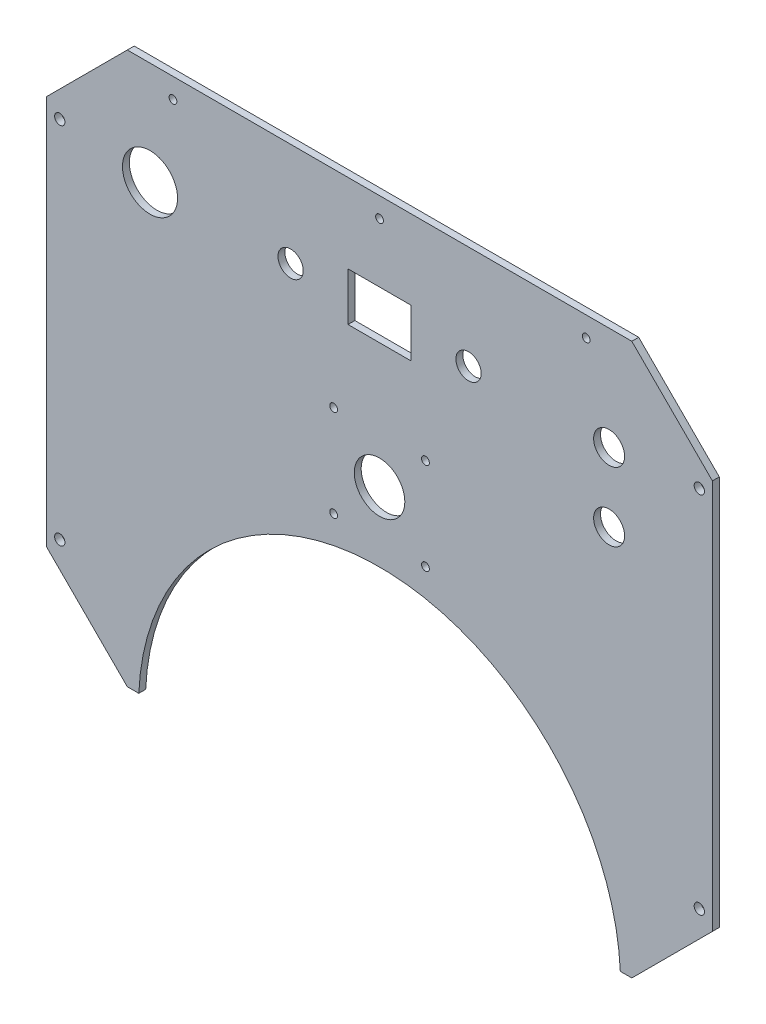
ISO-10303-21;
HEADER;
FILE_DESCRIPTION(('STEP AP214'),'2;1');
FILE_NAME('part.step','',(''),(''),'','','');
FILE_SCHEMA(('AUTOMOTIVE_DESIGN { 1 0 10303 214 1 1 1 1 }'));
ENDSEC;
DATA;
#1=APPLICATION_CONTEXT('core data for automotive mechanical design processes');
#2=APPLICATION_PROTOCOL_DEFINITION('international standard','automotive_design',2000,#1);
#3=PRODUCT_CONTEXT('',#1,'mechanical');
#4=PRODUCT('Part','Part','',(#3));
#5=PRODUCT_RELATED_PRODUCT_CATEGORY('part','',(#4));
#6=PRODUCT_DEFINITION_FORMATION('','',#4);
#7=PRODUCT_DEFINITION_CONTEXT('part definition',#1,'design');
#8=PRODUCT_DEFINITION('design','',#6,#7);
#9=PRODUCT_DEFINITION_SHAPE('','',#8);
#10=(LENGTH_UNIT() NAMED_UNIT(*) SI_UNIT(.MILLI.,.METRE.));
#11=(NAMED_UNIT(*) PLANE_ANGLE_UNIT() SI_UNIT($,.RADIAN.));
#12=(NAMED_UNIT(*) SI_UNIT($,.STERADIAN.) SOLID_ANGLE_UNIT());
#13=UNCERTAINTY_MEASURE_WITH_UNIT(LENGTH_MEASURE(1.E-05),#10,'distance_accuracy_value','');
#14=(GEOMETRIC_REPRESENTATION_CONTEXT(3) GLOBAL_UNCERTAINTY_ASSIGNED_CONTEXT((#13)) GLOBAL_UNIT_ASSIGNED_CONTEXT((#10,
#11,#12)) REPRESENTATION_CONTEXT('',''));
#15=CARTESIAN_POINT('',(0.,0.,0.));
#16=DIRECTION('',(0.,0.,1.));
#17=DIRECTION('',(1.,0.,0.));
#18=AXIS2_PLACEMENT_3D('',#15,#16,#17);
#19=CARTESIAN_POINT('',(-145.000000000024,84.9999999999824,3.));
#20=DIRECTION('',(1.,0.,0.));
#21=DIRECTION('',(0.,0.,-1.));
#22=AXIS2_PLACEMENT_3D('',#19,#20,#21);
#23=PLANE('',#22);
#24=DIRECTION('',(0.,-1.,0.));
#25=VECTOR('',#24,1.);
#26=CARTESIAN_POINT('',(-145.000000000024,84.9999999999824,0.));
#27=LINE('',#26,#25);
#28=CARTESIAN_POINT('',(-145.000000000024,84.9999999999824,0.));
#29=VERTEX_POINT('',#28);
#30=CARTESIAN_POINT('',(-145.000000000024,-85.0000000000195,0.));
#31=VERTEX_POINT('',#30);
#32=EDGE_CURVE('E217',#29,#31,#27,.T.);
#33=ORIENTED_EDGE('',*,*,#32,.T.);
#34=DIRECTION('',(0.,0.,-1.));
#35=VECTOR('',#34,1.);
#36=CARTESIAN_POINT('',(-145.000000000024,-85.0000000000195,3.));
#37=LINE('',#36,#35);
#38=CARTESIAN_POINT('',(-145.000000000024,-85.0000000000195,3.));
#39=VERTEX_POINT('',#38);
#40=EDGE_CURVE('E263',#39,#31,#37,.T.);
#41=ORIENTED_EDGE('',*,*,#40,.F.);
#42=DIRECTION('',(0.,-1.,0.));
#43=VECTOR('',#42,1.);
#44=CARTESIAN_POINT('',(-145.000000000024,84.9999999999824,3.));
#45=LINE('',#44,#43);
#46=CARTESIAN_POINT('',(-145.000000000024,84.9999999999824,3.));
#47=VERTEX_POINT('',#46);
#48=EDGE_CURVE('E194',#47,#39,#45,.T.);
#49=ORIENTED_EDGE('',*,*,#48,.F.);
#50=DIRECTION('',(0.,0.,-1.));
#51=VECTOR('',#50,1.);
#52=CARTESIAN_POINT('',(-145.000000000024,84.9999999999824,3.));
#53=LINE('',#52,#51);
#54=EDGE_CURVE('E216',#47,#29,#53,.T.);
#55=ORIENTED_EDGE('',*,*,#54,.T.);
#56=EDGE_LOOP('',(#33,#41,#49,#55));
#57=FACE_BOUND('',#56,.T.);
#58=ADVANCED_FACE('F31',(#57),#23,.F.);
#59=CARTESIAN_POINT('',(-145.000000000024,-85.0000000000195,3.));
#60=DIRECTION('',(0.707106781186488,0.707106781186606,0.));
#61=DIRECTION('',(-0.707106781186607,0.707106781186488,0.));
#62=AXIS2_PLACEMENT_3D('',#59,#60,#61);
#63=PLANE('',#62);
#64=DIRECTION('',(0.707106781186607,-0.707106781186489,0.));
#65=VECTOR('',#64,1.);
#66=CARTESIAN_POINT('',(-145.000000000024,-85.0000000000195,0.));
#67=LINE('',#66,#65);
#68=CARTESIAN_POINT('',(-109.886246000254,-120.113753999785,0.));
#69=VERTEX_POINT('',#68);
#70=EDGE_CURVE('E220',#31,#69,#67,.T.);
#71=ORIENTED_EDGE('',*,*,#70,.T.);
#72=DIRECTION('',(0.,0.,-1.));
#73=VECTOR('',#72,1.);
#74=CARTESIAN_POINT('',(-109.886246000254,-120.113753999785,3.));
#75=LINE('',#74,#73);
#76=CARTESIAN_POINT('',(-109.886246000254,-120.113753999785,3.));
#77=VERTEX_POINT('',#76);
#78=EDGE_CURVE('E260',#77,#69,#75,.T.);
#79=ORIENTED_EDGE('',*,*,#78,.F.);
#80=DIRECTION('',(0.707106781186607,-0.707106781186489,0.));
#81=VECTOR('',#80,1.);
#82=CARTESIAN_POINT('',(-145.000000000024,-85.0000000000195,3.));
#83=LINE('',#82,#81);
#84=EDGE_CURVE('E197',#39,#77,#83,.T.);
#85=ORIENTED_EDGE('',*,*,#84,.F.);
#86=ORIENTED_EDGE('',*,*,#40,.T.);
#87=EDGE_LOOP('',(#71,#79,#85,#86));
#88=FACE_BOUND('',#87,.T.);
#89=ADVANCED_FACE('F308',(#88),#63,.F.);
#90=CARTESIAN_POINT('',(-109.886246000254,-120.113753999785,3.));
#91=DIRECTION('',(0.,1.,0.));
#92=DIRECTION('',(0.,0.,1.));
#93=AXIS2_PLACEMENT_3D('',#90,#91,#92);
#94=PLANE('',#93);
#95=DIRECTION('',(1.,0.,0.));
#96=VECTOR('',#95,1.);
#97=CARTESIAN_POINT('',(-109.886246000254,-120.113753999785,0.));
#98=LINE('',#97,#96);
#99=CARTESIAN_POINT('',(-104.886246000252,-120.113753999785,0.));
#100=VERTEX_POINT('',#99);
#101=EDGE_CURVE('E222',#69,#100,#98,.T.);
#102=ORIENTED_EDGE('',*,*,#101,.T.);
#103=DIRECTION('',(0.,0.,-1.));
#104=VECTOR('',#103,1.);
#105=CARTESIAN_POINT('',(-104.886246000252,-120.113753999785,3.));
#106=LINE('',#105,#104);
#107=CARTESIAN_POINT('',(-104.886246000252,-120.113753999785,3.));
#108=VERTEX_POINT('',#107);
#109=EDGE_CURVE('E257',#108,#100,#106,.T.);
#110=ORIENTED_EDGE('',*,*,#109,.F.);
#111=DIRECTION('',(1.,0.,0.));
#112=VECTOR('',#111,1.);
#113=CARTESIAN_POINT('',(-109.886246000254,-120.113753999785,3.));
#114=LINE('',#113,#112);
#115=EDGE_CURVE('E200',#77,#108,#114,.T.);
#116=ORIENTED_EDGE('',*,*,#115,.F.);
#117=ORIENTED_EDGE('',*,*,#78,.T.);
#118=EDGE_LOOP('',(#102,#110,#116,#117));
#119=FACE_BOUND('',#118,.T.);
#120=ADVANCED_FACE('F313',(#119),#94,.F.);
#121=CARTESIAN_POINT('',(1.79238312827414E-13,-125.000000000053,3.));
#122=DIRECTION('',(0.,0.,-1.));
#123=DIRECTION('',(-1.,0.,0.));
#124=AXIS2_PLACEMENT_3D('',#121,#122,#123);
#125=CYLINDRICAL_SURFACE('',#124,105.000000000003);
#126=CARTESIAN_POINT('',(1.79238312827414E-13,-125.000000000053,0.));
#127=DIRECTION('',(0.,0.,-1.));
#128=DIRECTION('',(-1.,0.,0.));
#129=AXIS2_PLACEMENT_3D('',#126,#127,#128);
#130=CIRCLE('',#129,105.000000000003);
#131=CARTESIAN_POINT('',(104.886246000251,-120.113753999787,0.));
#132=VERTEX_POINT('',#131);
#133=EDGE_CURVE('E224',#100,#132,#130,.T.);
#134=ORIENTED_EDGE('',*,*,#133,.T.);
#135=DIRECTION('',(0.,0.,-1.));
#136=VECTOR('',#135,1.);
#137=CARTESIAN_POINT('',(104.886246000251,-120.113753999787,3.));
#138=LINE('',#137,#136);
#139=CARTESIAN_POINT('',(104.886246000251,-120.113753999787,3.));
#140=VERTEX_POINT('',#139);
#141=EDGE_CURVE('E254',#140,#132,#138,.T.);
#142=ORIENTED_EDGE('',*,*,#141,.F.);
#143=CARTESIAN_POINT('',(1.79238312827414E-13,-125.000000000053,3.));
#144=DIRECTION('',(0.,0.,-1.));
#145=DIRECTION('',(-1.,0.,0.));
#146=AXIS2_PLACEMENT_3D('',#143,#144,#145);
#147=CIRCLE('',#146,105.000000000003);
#148=EDGE_CURVE('E202',#108,#140,#147,.T.);
#149=ORIENTED_EDGE('',*,*,#148,.F.);
#150=ORIENTED_EDGE('',*,*,#109,.T.);
#151=EDGE_LOOP('',(#134,#142,#149,#150));
#152=FACE_BOUND('',#151,.T.);
#153=ADVANCED_FACE('F357',(#152),#125,.F.);
#154=CARTESIAN_POINT('',(104.886246000251,-120.113753999787,3.));
#155=DIRECTION('',(-2.02615701994132E-13,1.,0.));
#156=DIRECTION('',(-1.,-2.02615701994132E-13,0.));
#157=AXIS2_PLACEMENT_3D('',#154,#155,#156);
#158=PLANE('',#157);
#159=DIRECTION('',(1.,2.02615701994132E-13,0.));
#160=VECTOR('',#159,1.);
#161=CARTESIAN_POINT('',(104.886246000251,-120.113753999787,0.));
#162=LINE('',#161,#160);
#163=CARTESIAN_POINT('',(109.88624600025,-120.113753999786,0.));
#164=VERTEX_POINT('',#163);
#165=EDGE_CURVE('E226',#132,#164,#162,.T.);
#166=ORIENTED_EDGE('',*,*,#165,.T.);
#167=DIRECTION('',(0.,0.,-1.));
#168=VECTOR('',#167,1.);
#169=CARTESIAN_POINT('',(109.88624600025,-120.113753999786,3.));
#170=LINE('',#169,#168);
#171=CARTESIAN_POINT('',(109.88624600025,-120.113753999786,3.));
#172=VERTEX_POINT('',#171);
#173=EDGE_CURVE('E251',#172,#164,#170,.T.);
#174=ORIENTED_EDGE('',*,*,#173,.F.);
#175=DIRECTION('',(1.,2.02615701994132E-13,0.));
#176=VECTOR('',#175,1.);
#177=CARTESIAN_POINT('',(104.886246000251,-120.113753999787,3.));
#178=LINE('',#177,#176);
#179=EDGE_CURVE('E204',#140,#172,#178,.T.);
#180=ORIENTED_EDGE('',*,*,#179,.F.);
#181=ORIENTED_EDGE('',*,*,#141,.T.);
#182=EDGE_LOOP('',(#166,#174,#180,#181));
#183=FACE_BOUND('',#182,.T.);
#184=ADVANCED_FACE('F352',(#183),#158,.F.);
#185=CARTESIAN_POINT('',(109.88624600025,-120.113753999786,3.));
#186=DIRECTION('',(-0.707106781186464,0.707106781186631,0.));
#187=DIRECTION('',(-0.707106781186631,-0.707106781186464,0.));
#188=AXIS2_PLACEMENT_3D('',#185,#186,#187);
#189=PLANE('',#188);
#190=DIRECTION('',(0.707106781186631,0.707106781186464,0.));
#191=VECTOR('',#190,1.);
#192=CARTESIAN_POINT('',(109.88624600025,-120.113753999786,0.));
#193=LINE('',#192,#191);
#194=CARTESIAN_POINT('',(145.000000000025,-85.0000000000195,0.));
#195=VERTEX_POINT('',#194);
#196=EDGE_CURVE('E228',#164,#195,#193,.T.);
#197=ORIENTED_EDGE('',*,*,#196,.T.);
#198=DIRECTION('',(0.,0.,-1.));
#199=VECTOR('',#198,1.);
#200=CARTESIAN_POINT('',(145.000000000025,-85.0000000000195,3.));
#201=LINE('',#200,#199);
#202=CARTESIAN_POINT('',(145.000000000025,-85.0000000000195,3.));
#203=VERTEX_POINT('',#202);
#204=EDGE_CURVE('E248',#203,#195,#201,.T.);
#205=ORIENTED_EDGE('',*,*,#204,.F.);
#206=DIRECTION('',(0.707106781186631,0.707106781186464,0.));
#207=VECTOR('',#206,1.);
#208=CARTESIAN_POINT('',(109.88624600025,-120.113753999786,3.));
#209=LINE('',#208,#207);
#210=EDGE_CURVE('E206',#172,#203,#209,.T.);
#211=ORIENTED_EDGE('',*,*,#210,.F.);
#212=ORIENTED_EDGE('',*,*,#173,.T.);
#213=EDGE_LOOP('',(#197,#205,#211,#212));
#214=FACE_BOUND('',#213,.T.);
#215=ADVANCED_FACE('F348',(#214),#189,.F.);
#216=CARTESIAN_POINT('',(145.000000000025,84.9999999999824,3.));
#217=DIRECTION('',(-1.,0.,0.));
#218=DIRECTION('',(0.,0.,1.));
#219=AXIS2_PLACEMENT_3D('',#216,#217,#218);
#220=PLANE('',#219);
#221=DIRECTION('',(0.,1.,0.));
#222=VECTOR('',#221,1.);
#223=CARTESIAN_POINT('',(145.000000000025,84.9999999999824,0.));
#224=LINE('',#223,#222);
#225=CARTESIAN_POINT('',(145.000000000025,84.9999999999824,0.));
#226=VERTEX_POINT('',#225);
#227=EDGE_CURVE('E230',#195,#226,#224,.T.);
#228=ORIENTED_EDGE('',*,*,#227,.T.);
#229=DIRECTION('',(0.,0.,-1.));
#230=VECTOR('',#229,1.);
#231=CARTESIAN_POINT('',(145.000000000025,84.9999999999824,3.));
#232=LINE('',#231,#230);
#233=CARTESIAN_POINT('',(145.000000000025,84.9999999999824,3.));
#234=VERTEX_POINT('',#233);
#235=EDGE_CURVE('E245',#234,#226,#232,.T.);
#236=ORIENTED_EDGE('',*,*,#235,.F.);
#237=DIRECTION('',(0.,1.,0.));
#238=VECTOR('',#237,1.);
#239=CARTESIAN_POINT('',(145.000000000025,84.9999999999824,3.));
#240=LINE('',#239,#238);
#241=EDGE_CURVE('E208',#203,#234,#240,.T.);
#242=ORIENTED_EDGE('',*,*,#241,.F.);
#243=ORIENTED_EDGE('',*,*,#204,.T.);
#244=EDGE_LOOP('',(#228,#236,#242,#243));
#245=FACE_BOUND('',#244,.T.);
#246=ADVANCED_FACE('F344',(#245),#220,.F.);
#247=CARTESIAN_POINT('',(109.886246000254,120.113753999748,3.));
#248=DIRECTION('',(-0.707106781186489,-0.707106781186606,0.));
#249=DIRECTION('',(0.707106781186606,-0.707106781186489,0.));
#250=AXIS2_PLACEMENT_3D('',#247,#248,#249);
#251=PLANE('',#250);
#252=DIRECTION('',(-0.707106781186606,0.707106781186489,0.));
#253=VECTOR('',#252,1.);
#254=CARTESIAN_POINT('',(109.886246000254,120.113753999748,0.));
#255=LINE('',#254,#253);
#256=CARTESIAN_POINT('',(109.886246000254,120.113753999748,0.));
#257=VERTEX_POINT('',#256);
#258=EDGE_CURVE('E232',#226,#257,#255,.T.);
#259=ORIENTED_EDGE('',*,*,#258,.T.);
#260=DIRECTION('',(0.,0.,-1.));
#261=VECTOR('',#260,1.);
#262=CARTESIAN_POINT('',(109.886246000254,120.113753999748,3.));
#263=LINE('',#262,#261);
#264=CARTESIAN_POINT('',(109.886246000254,120.113753999748,3.));
#265=VERTEX_POINT('',#264);
#266=EDGE_CURVE('E242',#265,#257,#263,.T.);
#267=ORIENTED_EDGE('',*,*,#266,.F.);
#268=DIRECTION('',(-0.707106781186606,0.707106781186489,0.));
#269=VECTOR('',#268,1.);
#270=CARTESIAN_POINT('',(109.886246000254,120.113753999748,3.));
#271=LINE('',#270,#269);
#272=EDGE_CURVE('E210',#234,#265,#271,.T.);
#273=ORIENTED_EDGE('',*,*,#272,.F.);
#274=ORIENTED_EDGE('',*,*,#235,.T.);
#275=EDGE_LOOP('',(#259,#267,#273,#274));
#276=FACE_BOUND('',#275,.T.);
#277=ADVANCED_FACE('F339',(#276),#251,.F.);
#278=CARTESIAN_POINT('',(-109.886246000254,120.113753999747,3.));
#279=DIRECTION('',(0.,-1.,0.));
#280=DIRECTION('',(1.,0.,0.));
#281=AXIS2_PLACEMENT_3D('',#278,#279,#280);
#282=PLANE('',#281);
#283=DIRECTION('',(-1.,0.,0.));
#284=VECTOR('',#283,1.);
#285=CARTESIAN_POINT('',(-109.886246000254,120.113753999747,0.));
#286=LINE('',#285,#284);
#287=CARTESIAN_POINT('',(-109.886246000254,120.113753999747,0.));
#288=VERTEX_POINT('',#287);
#289=EDGE_CURVE('E234',#257,#288,#286,.T.);
#290=ORIENTED_EDGE('',*,*,#289,.T.);
#291=DIRECTION('',(0.,0.,-1.));
#292=VECTOR('',#291,1.);
#293=CARTESIAN_POINT('',(-109.886246000254,120.113753999747,3.));
#294=LINE('',#293,#292);
#295=CARTESIAN_POINT('',(-109.886246000254,120.113753999747,3.));
#296=VERTEX_POINT('',#295);
#297=EDGE_CURVE('E239',#296,#288,#294,.T.);
#298=ORIENTED_EDGE('',*,*,#297,.F.);
#299=DIRECTION('',(-1.,0.,0.));
#300=VECTOR('',#299,1.);
#301=CARTESIAN_POINT('',(-109.886246000254,120.113753999747,3.));
#302=LINE('',#301,#300);
#303=EDGE_CURVE('E212',#265,#296,#302,.T.);
#304=ORIENTED_EDGE('',*,*,#303,.F.);
#305=ORIENTED_EDGE('',*,*,#266,.T.);
#306=EDGE_LOOP('',(#290,#298,#304,#305));
#307=FACE_BOUND('',#306,.T.);
#308=ADVANCED_FACE('F333',(#307),#282,.F.);
#309=CARTESIAN_POINT('',(-145.000000000024,84.9999999999824,3.));
#310=DIRECTION('',(0.707106781186488,-0.707106781186606,0.));
#311=DIRECTION('',(0.707106781186607,0.707106781186488,0.));
#312=AXIS2_PLACEMENT_3D('',#309,#310,#311);
#313=PLANE('',#312);
#314=DIRECTION('',(-0.707106781186607,-0.707106781186489,0.));
#315=VECTOR('',#314,1.);
#316=CARTESIAN_POINT('',(-145.000000000024,84.9999999999824,0.));
#317=LINE('',#316,#315);
#318=EDGE_CURVE('E198',#288,#29,#317,.T.);
#319=ORIENTED_EDGE('',*,*,#318,.T.);
#320=ORIENTED_EDGE('',*,*,#54,.F.);
#321=DIRECTION('',(-0.707106781186607,-0.707106781186489,0.));
#322=VECTOR('',#321,1.);
#323=CARTESIAN_POINT('',(-145.000000000024,84.9999999999824,3.));
#324=LINE('',#323,#322);
#325=EDGE_CURVE('E214',#296,#47,#324,.T.);
#326=ORIENTED_EDGE('',*,*,#325,.F.);
#327=ORIENTED_EDGE('',*,*,#297,.T.);
#328=EDGE_LOOP('',(#319,#320,#326,#327));
#329=FACE_BOUND('',#328,.T.);
#330=ADVANCED_FACE('F331',(#329),#313,.F.);
#331=CARTESIAN_POINT('',(1.79238312827414E-13,-125.000000000053,3.));
#332=DIRECTION('',(0.,0.,-1.));
#333=DIRECTION('',(-1.,0.,0.));
#334=AXIS2_PLACEMENT_3D('',#331,#332,#333);
#335=PLANE('',#334);
#336=CARTESIAN_POINT('',(-20.,30.1137539997475,3.));
#337=DIRECTION('',(0.,0.,1.));
#338=DIRECTION('',(1.,0.,0.));
#339=AXIS2_PLACEMENT_3D('',#336,#337,#338);
#340=CIRCLE('',#339,1.69999999999999);
#341=CARTESIAN_POINT('',(-18.3,30.1137539997475,3.));
#342=VERTEX_POINT('',#341);
#343=EDGE_CURVE('E586',#342,#342,#340,.T.);
#344=ORIENTED_EDGE('',*,*,#343,.F.);
#345=EDGE_LOOP('',(#344));
#346=FACE_BOUND('',#345,.T.);
#347=CARTESIAN_POINT('',(20.,30.1137539997475,3.));
#348=DIRECTION('',(0.,0.,1.));
#349=DIRECTION('',(1.,0.,0.));
#350=AXIS2_PLACEMENT_3D('',#347,#348,#349);
#351=CIRCLE('',#350,1.69999999999999);
#352=CARTESIAN_POINT('',(21.7,30.1137539997475,3.));
#353=VERTEX_POINT('',#352);
#354=EDGE_CURVE('E588',#353,#353,#351,.T.);
#355=ORIENTED_EDGE('',*,*,#354,.F.);
#356=EDGE_LOOP('',(#355));
#357=FACE_BOUND('',#356,.T.);
#358=CARTESIAN_POINT('',(20.,-9.8862460002525,3.));
#359=DIRECTION('',(0.,0.,1.));
#360=DIRECTION('',(1.,0.,0.));
#361=AXIS2_PLACEMENT_3D('',#358,#359,#360);
#362=CIRCLE('',#361,1.69999999999999);
#363=CARTESIAN_POINT('',(21.7,-9.8862460002525,3.));
#364=VERTEX_POINT('',#363);
#365=EDGE_CURVE('E596',#364,#364,#362,.T.);
#366=ORIENTED_EDGE('',*,*,#365,.F.);
#367=EDGE_LOOP('',(#366));
#368=FACE_BOUND('',#367,.T.);
#369=CARTESIAN_POINT('',(-20.,-9.8862460002525,3.));
#370=DIRECTION('',(0.,0.,1.));
#371=DIRECTION('',(1.,0.,0.));
#372=AXIS2_PLACEMENT_3D('',#369,#370,#371);
#373=CIRCLE('',#372,1.69999999999999);
#374=CARTESIAN_POINT('',(-18.3,-9.8862460002525,3.));
#375=VERTEX_POINT('',#374);
#376=EDGE_CURVE('E602',#375,#375,#373,.T.);
#377=ORIENTED_EDGE('',*,*,#376,.F.);
#378=EDGE_LOOP('',(#377));
#379=FACE_BOUND('',#378,.T.);
#380=CARTESIAN_POINT('',(0.,10.1137539997475,3.));
#381=DIRECTION('',(0.,0.,1.));
#382=DIRECTION('',(1.,0.,0.));
#383=AXIS2_PLACEMENT_3D('',#380,#381,#382);
#384=CIRCLE('',#383,11.);
#385=CARTESIAN_POINT('',(11.,10.1137539997475,3.));
#386=VERTEX_POINT('',#385);
#387=EDGE_CURVE('E608',#386,#386,#384,.T.);
#388=ORIENTED_EDGE('',*,*,#387,.F.);
#389=EDGE_LOOP('',(#388));
#390=FACE_BOUND('',#389,.T.);
#391=CARTESIAN_POINT('',(0.,111.413753999748,3.));
#392=DIRECTION('',(0.,0.,1.));
#393=DIRECTION('',(1.,0.,0.));
#394=AXIS2_PLACEMENT_3D('',#391,#392,#393);
#395=CIRCLE('',#394,1.69999999999999);
#396=CARTESIAN_POINT('',(1.69999999999999,111.413753999748,3.));
#397=VERTEX_POINT('',#396);
#398=EDGE_CURVE('E614',#397,#397,#395,.T.);
#399=ORIENTED_EDGE('',*,*,#398,.F.);
#400=EDGE_LOOP('',(#399));
#401=FACE_BOUND('',#400,.T.);
#402=CARTESIAN_POINT('',(-89.9999999999969,111.413753999747,3.));
#403=DIRECTION('',(0.,0.,1.));
#404=DIRECTION('',(1.,0.,0.));
#405=AXIS2_PLACEMENT_3D('',#402,#403,#404);
#406=CIRCLE('',#405,1.69999999999999);
#407=CARTESIAN_POINT('',(-88.2999999999969,111.413753999747,3.));
#408=VERTEX_POINT('',#407);
#409=EDGE_CURVE('E620',#408,#408,#406,.T.);
#410=ORIENTED_EDGE('',*,*,#409,.F.);
#411=EDGE_LOOP('',(#410));
#412=FACE_BOUND('',#411,.T.);
#413=CARTESIAN_POINT('',(90.0000000000031,111.413753999747,3.));
#414=DIRECTION('',(0.,0.,1.));
#415=DIRECTION('',(1.,0.,0.));
#416=AXIS2_PLACEMENT_3D('',#413,#414,#415);
#417=CIRCLE('',#416,1.69999999999999);
#418=CARTESIAN_POINT('',(91.7000000000031,111.413753999747,3.));
#419=VERTEX_POINT('',#418);
#420=EDGE_CURVE('E626',#419,#419,#417,.T.);
#421=ORIENTED_EDGE('',*,*,#420,.F.);
#422=EDGE_LOOP('',(#421));
#423=FACE_BOUND('',#422,.T.);
#424=DIRECTION('',(1.,0.,0.));
#425=VECTOR('',#424,1.);
#426=CARTESIAN_POINT('',(-13.75,64.6137539997475,3.));
#427=LINE('',#426,#425);
#428=CARTESIAN_POINT('',(-13.75,64.6137539997475,3.));
#429=VERTEX_POINT('',#428);
#430=CARTESIAN_POINT('',(13.75,64.6137539997475,3.));
#431=VERTEX_POINT('',#430);
#432=EDGE_CURVE('E142',#429,#431,#427,.T.);
#433=ORIENTED_EDGE('',*,*,#432,.F.);
#434=DIRECTION('',(0.,-1.,0.));
#435=VECTOR('',#434,1.);
#436=CARTESIAN_POINT('',(-13.75,85.6137539997475,3.));
#437=LINE('',#436,#435);
#438=CARTESIAN_POINT('',(-13.75,85.6137539997475,3.));
#439=VERTEX_POINT('',#438);
#440=EDGE_CURVE('E45',#439,#429,#437,.T.);
#441=ORIENTED_EDGE('',*,*,#440,.F.);
#442=DIRECTION('',(1.,0.,0.));
#443=VECTOR('',#442,1.);
#444=CARTESIAN_POINT('',(-13.75,85.6137539997475,3.));
#445=LINE('',#444,#443);
#446=CARTESIAN_POINT('',(13.75,85.6137539997475,3.));
#447=VERTEX_POINT('',#446);
#448=EDGE_CURVE('E149',#439,#447,#445,.T.);
#449=ORIENTED_EDGE('',*,*,#448,.T.);
#450=DIRECTION('',(0.,-1.,0.));
#451=VECTOR('',#450,1.);
#452=CARTESIAN_POINT('',(13.75,85.6137539997475,3.));
#453=LINE('',#452,#451);
#454=EDGE_CURVE('E133',#447,#431,#453,.T.);
#455=ORIENTED_EDGE('',*,*,#454,.T.);
#456=EDGE_LOOP('',(#433,#441,#449,#455));
#457=FACE_BOUND('',#456,.T.);
#458=CARTESIAN_POINT('',(-38.75,75.1137539997475,3.));
#459=DIRECTION('',(0.,0.,1.));
#460=DIRECTION('',(1.,0.,0.));
#461=AXIS2_PLACEMENT_3D('',#458,#459,#460);
#462=CIRCLE('',#461,5.5);
#463=CARTESIAN_POINT('',(-33.25,75.1137539997475,3.));
#464=VERTEX_POINT('',#463);
#465=EDGE_CURVE('E156',#464,#464,#462,.T.);
#466=ORIENTED_EDGE('',*,*,#465,.F.);
#467=EDGE_LOOP('',(#466));
#468=FACE_BOUND('',#467,.T.);
#469=CARTESIAN_POINT('',(38.75,75.1137539997475,3.));
#470=DIRECTION('',(0.,0.,1.));
#471=DIRECTION('',(1.,0.,0.));
#472=AXIS2_PLACEMENT_3D('',#469,#470,#471);
#473=CIRCLE('',#472,5.5);
#474=CARTESIAN_POINT('',(44.25,75.1137539997475,3.));
#475=VERTEX_POINT('',#474);
#476=EDGE_CURVE('E162',#475,#475,#473,.T.);
#477=ORIENTED_EDGE('',*,*,#476,.F.);
#478=EDGE_LOOP('',(#477));
#479=FACE_BOUND('',#478,.T.);
#480=CARTESIAN_POINT('',(100.000000000025,75.1137539997475,3.));
#481=DIRECTION('',(0.,0.,1.));
#482=DIRECTION('',(1.,0.,0.));
#483=AXIS2_PLACEMENT_3D('',#480,#481,#482);
#484=CIRCLE('',#483,6.74999999999999);
#485=CARTESIAN_POINT('',(106.750000000025,75.1137539997475,3.));
#486=VERTEX_POINT('',#485);
#487=EDGE_CURVE('E166',#486,#486,#484,.T.);
#488=ORIENTED_EDGE('',*,*,#487,.F.);
#489=EDGE_LOOP('',(#488));
#490=FACE_BOUND('',#489,.T.);
#491=CARTESIAN_POINT('',(100.000000000025,45.1137539997475,3.));
#492=DIRECTION('',(0.,0.,1.));
#493=DIRECTION('',(1.,0.,0.));
#494=AXIS2_PLACEMENT_3D('',#491,#492,#493);
#495=CIRCLE('',#494,6.74999999999999);
#496=CARTESIAN_POINT('',(106.750000000025,45.1137539997475,3.));
#497=VERTEX_POINT('',#496);
#498=EDGE_CURVE('E170',#497,#497,#495,.T.);
#499=ORIENTED_EDGE('',*,*,#498,.F.);
#500=EDGE_LOOP('',(#499));
#501=FACE_BOUND('',#500,.T.);
#502=CARTESIAN_POINT('',(-100.000000000024,75.1137539997475,3.));
#503=DIRECTION('',(0.,0.,1.));
#504=DIRECTION('',(1.,0.,0.));
#505=AXIS2_PLACEMENT_3D('',#502,#503,#504);
#506=CIRCLE('',#505,12.);
#507=CARTESIAN_POINT('',(-88.0000000000245,75.1137539997475,3.));
#508=VERTEX_POINT('',#507);
#509=EDGE_CURVE('E174',#508,#508,#506,.T.);
#510=ORIENTED_EDGE('',*,*,#509,.F.);
#511=EDGE_LOOP('',(#510));
#512=FACE_BOUND('',#511,.T.);
#513=CARTESIAN_POINT('',(-139.300000000024,79.2999999999825,3.));
#514=DIRECTION('',(0.,0.,1.));
#515=DIRECTION('',(1.,0.,0.));
#516=AXIS2_PLACEMENT_3D('',#513,#514,#515);
#517=CIRCLE('',#516,2.25);
#518=CARTESIAN_POINT('',(-137.050000000024,79.2999999999825,3.));
#519=VERTEX_POINT('',#518);
#520=EDGE_CURVE('E178',#519,#519,#517,.T.);
#521=ORIENTED_EDGE('',*,*,#520,.F.);
#522=EDGE_LOOP('',(#521));
#523=FACE_BOUND('',#522,.T.);
#524=CARTESIAN_POINT('',(-139.300000000024,-79.2999999999825,3.));
#525=DIRECTION('',(0.,0.,1.));
#526=DIRECTION('',(1.,0.,0.));
#527=AXIS2_PLACEMENT_3D('',#524,#525,#526);
#528=CIRCLE('',#527,2.25);
#529=CARTESIAN_POINT('',(-137.050000000024,-79.2999999999825,3.));
#530=VERTEX_POINT('',#529);
#531=EDGE_CURVE('E182',#530,#530,#528,.T.);
#532=ORIENTED_EDGE('',*,*,#531,.F.);
#533=EDGE_LOOP('',(#532));
#534=FACE_BOUND('',#533,.T.);
#535=CARTESIAN_POINT('',(139.300000000024,-79.2999999999834,3.));
#536=DIRECTION('',(0.,0.,1.));
#537=DIRECTION('',(1.,0.,0.));
#538=AXIS2_PLACEMENT_3D('',#535,#536,#537);
#539=CIRCLE('',#538,2.25);
#540=CARTESIAN_POINT('',(141.550000000024,-79.2999999999834,3.));
#541=VERTEX_POINT('',#540);
#542=EDGE_CURVE('E186',#541,#541,#539,.T.);
#543=ORIENTED_EDGE('',*,*,#542,.F.);
#544=EDGE_LOOP('',(#543));
#545=FACE_BOUND('',#544,.T.);
#546=CARTESIAN_POINT('',(139.300000000024,79.2999999999834,3.));
#547=DIRECTION('',(0.,0.,1.));
#548=DIRECTION('',(1.,0.,0.));
#549=AXIS2_PLACEMENT_3D('',#546,#547,#548);
#550=CIRCLE('',#549,2.25);
#551=CARTESIAN_POINT('',(141.550000000024,79.2999999999834,3.));
#552=VERTEX_POINT('',#551);
#553=EDGE_CURVE('E190',#552,#552,#550,.T.);
#554=ORIENTED_EDGE('',*,*,#553,.F.);
#555=EDGE_LOOP('',(#554));
#556=FACE_BOUND('',#555,.T.);
#557=ORIENTED_EDGE('',*,*,#48,.T.);
#558=ORIENTED_EDGE('',*,*,#84,.T.);
#559=ORIENTED_EDGE('',*,*,#115,.T.);
#560=ORIENTED_EDGE('',*,*,#148,.T.);
#561=ORIENTED_EDGE('',*,*,#179,.T.);
#562=ORIENTED_EDGE('',*,*,#210,.T.);
#563=ORIENTED_EDGE('',*,*,#241,.T.);
#564=ORIENTED_EDGE('',*,*,#272,.T.);
#565=ORIENTED_EDGE('',*,*,#303,.T.);
#566=ORIENTED_EDGE('',*,*,#325,.T.);
#567=EDGE_LOOP('',(#557,#558,#559,#560,#561,#562,#563,#564,#565,#566));
#568=FACE_BOUND('',#567,.T.);
#569=ADVANCED_FACE('F146',(#346,#357,#368,#379,#390,#401,#412,#423,#457,#468,#479,#490,#501,
#512,#523,#534,#545,#556,#568),#335,.F.);
#570=CARTESIAN_POINT('',(1.79238312827414E-13,-125.000000000053,0.));
#571=DIRECTION('',(0.,0.,-1.));
#572=DIRECTION('',(-1.,0.,0.));
#573=AXIS2_PLACEMENT_3D('',#570,#571,#572);
#574=PLANE('',#573);
#575=CARTESIAN_POINT('',(-20.,30.1137539997475,0.));
#576=DIRECTION('',(0.,0.,1.));
#577=DIRECTION('',(1.,0.,0.));
#578=AXIS2_PLACEMENT_3D('',#575,#576,#577);
#579=CIRCLE('',#578,1.7);
#580=CARTESIAN_POINT('',(-18.3,30.1137539997475,0.));
#581=VERTEX_POINT('',#580);
#582=EDGE_CURVE('E583',#581,#581,#579,.T.);
#583=ORIENTED_EDGE('',*,*,#582,.T.);
#584=EDGE_LOOP('',(#583));
#585=FACE_BOUND('',#584,.T.);
#586=CARTESIAN_POINT('',(20.,30.1137539997475,0.));
#587=DIRECTION('',(0.,0.,1.));
#588=DIRECTION('',(1.,0.,0.));
#589=AXIS2_PLACEMENT_3D('',#586,#587,#588);
#590=CIRCLE('',#589,1.7);
#591=CARTESIAN_POINT('',(21.7,30.1137539997475,0.));
#592=VERTEX_POINT('',#591);
#593=EDGE_CURVE('E593',#592,#592,#590,.T.);
#594=ORIENTED_EDGE('',*,*,#593,.T.);
#595=EDGE_LOOP('',(#594));
#596=FACE_BOUND('',#595,.T.);
#597=CARTESIAN_POINT('',(20.,-9.8862460002525,0.));
#598=DIRECTION('',(0.,0.,1.));
#599=DIRECTION('',(1.,0.,0.));
#600=AXIS2_PLACEMENT_3D('',#597,#598,#599);
#601=CIRCLE('',#600,1.7);
#602=CARTESIAN_POINT('',(21.7,-9.8862460002525,0.));
#603=VERTEX_POINT('',#602);
#604=EDGE_CURVE('E599',#603,#603,#601,.T.);
#605=ORIENTED_EDGE('',*,*,#604,.T.);
#606=EDGE_LOOP('',(#605));
#607=FACE_BOUND('',#606,.T.);
#608=CARTESIAN_POINT('',(-20.,-9.8862460002525,0.));
#609=DIRECTION('',(0.,0.,1.));
#610=DIRECTION('',(1.,0.,0.));
#611=AXIS2_PLACEMENT_3D('',#608,#609,#610);
#612=CIRCLE('',#611,1.7);
#613=CARTESIAN_POINT('',(-18.3,-9.8862460002525,0.));
#614=VERTEX_POINT('',#613);
#615=EDGE_CURVE('E605',#614,#614,#612,.T.);
#616=ORIENTED_EDGE('',*,*,#615,.T.);
#617=EDGE_LOOP('',(#616));
#618=FACE_BOUND('',#617,.T.);
#619=CARTESIAN_POINT('',(0.,10.1137539997475,0.));
#620=DIRECTION('',(0.,0.,1.));
#621=DIRECTION('',(1.,0.,0.));
#622=AXIS2_PLACEMENT_3D('',#619,#620,#621);
#623=CIRCLE('',#622,11.);
#624=CARTESIAN_POINT('',(11.,10.1137539997475,0.));
#625=VERTEX_POINT('',#624);
#626=EDGE_CURVE('E611',#625,#625,#623,.T.);
#627=ORIENTED_EDGE('',*,*,#626,.T.);
#628=EDGE_LOOP('',(#627));
#629=FACE_BOUND('',#628,.T.);
#630=CARTESIAN_POINT('',(0.,111.413753999748,0.));
#631=DIRECTION('',(0.,0.,1.));
#632=DIRECTION('',(1.,0.,0.));
#633=AXIS2_PLACEMENT_3D('',#630,#631,#632);
#634=CIRCLE('',#633,1.7);
#635=CARTESIAN_POINT('',(1.7,111.413753999748,0.));
#636=VERTEX_POINT('',#635);
#637=EDGE_CURVE('E617',#636,#636,#634,.T.);
#638=ORIENTED_EDGE('',*,*,#637,.T.);
#639=EDGE_LOOP('',(#638));
#640=FACE_BOUND('',#639,.T.);
#641=CARTESIAN_POINT('',(-89.9999999999969,111.413753999747,0.));
#642=DIRECTION('',(0.,0.,1.));
#643=DIRECTION('',(1.,0.,0.));
#644=AXIS2_PLACEMENT_3D('',#641,#642,#643);
#645=CIRCLE('',#644,1.69999999999999);
#646=CARTESIAN_POINT('',(-88.2999999999969,111.413753999747,0.));
#647=VERTEX_POINT('',#646);
#648=EDGE_CURVE('E623',#647,#647,#645,.T.);
#649=ORIENTED_EDGE('',*,*,#648,.T.);
#650=EDGE_LOOP('',(#649));
#651=FACE_BOUND('',#650,.T.);
#652=CARTESIAN_POINT('',(90.0000000000031,111.413753999747,0.));
#653=DIRECTION('',(0.,0.,1.));
#654=DIRECTION('',(1.,0.,0.));
#655=AXIS2_PLACEMENT_3D('',#652,#653,#654);
#656=CIRCLE('',#655,1.69999999999999);
#657=CARTESIAN_POINT('',(91.7000000000031,111.413753999747,0.));
#658=VERTEX_POINT('',#657);
#659=EDGE_CURVE('E629',#658,#658,#656,.T.);
#660=ORIENTED_EDGE('',*,*,#659,.T.);
#661=EDGE_LOOP('',(#660));
#662=FACE_BOUND('',#661,.T.);
#663=DIRECTION('',(0.,1.,0.));
#664=VECTOR('',#663,1.);
#665=CARTESIAN_POINT('',(-13.75,-125.000000000053,0.));
#666=LINE('',#665,#664);
#667=CARTESIAN_POINT('',(-13.75,64.6137539997475,0.));
#668=VERTEX_POINT('',#667);
#669=CARTESIAN_POINT('',(-13.75,85.6137539997475,0.));
#670=VERTEX_POINT('',#669);
#671=EDGE_CURVE('E11',#668,#670,#666,.T.);
#672=ORIENTED_EDGE('',*,*,#671,.F.);
#673=DIRECTION('',(-1.,0.,0.));
#674=VECTOR('',#673,1.);
#675=CARTESIAN_POINT('',(1.79238312827414E-13,64.6137539997475,0.));
#676=LINE('',#675,#674);
#677=CARTESIAN_POINT('',(13.75,64.6137539997475,0.));
#678=VERTEX_POINT('',#677);
#679=EDGE_CURVE('E266',#678,#668,#676,.T.);
#680=ORIENTED_EDGE('',*,*,#679,.F.);
#681=DIRECTION('',(0.,1.,0.));
#682=VECTOR('',#681,1.);
#683=CARTESIAN_POINT('',(13.75,-125.000000000053,0.));
#684=LINE('',#683,#682);
#685=CARTESIAN_POINT('',(13.75,85.6137539997475,0.));
#686=VERTEX_POINT('',#685);
#687=EDGE_CURVE('E136',#678,#686,#684,.T.);
#688=ORIENTED_EDGE('',*,*,#687,.T.);
#689=DIRECTION('',(-1.,0.,0.));
#690=VECTOR('',#689,1.);
#691=CARTESIAN_POINT('',(1.79238312827414E-13,85.6137539997475,0.));
#692=LINE('',#691,#690);
#693=EDGE_CURVE('E38',#686,#670,#692,.T.);
#694=ORIENTED_EDGE('',*,*,#693,.T.);
#695=EDGE_LOOP('',(#672,#680,#688,#694));
#696=FACE_BOUND('',#695,.T.);
#697=CARTESIAN_POINT('',(-38.75,75.1137539997475,0.));
#698=DIRECTION('',(0.,0.,-1.));
#699=DIRECTION('',(-1.,0.,0.));
#700=AXIS2_PLACEMENT_3D('',#697,#698,#699);
#701=CIRCLE('',#700,5.5);
#702=CARTESIAN_POINT('',(-44.25,75.1137539997475,0.));
#703=VERTEX_POINT('',#702);
#704=EDGE_CURVE('E161',#703,#703,#701,.T.);
#705=ORIENTED_EDGE('',*,*,#704,.F.);
#706=EDGE_LOOP('',(#705));
#707=FACE_BOUND('',#706,.T.);
#708=CARTESIAN_POINT('',(38.75,75.1137539997475,0.));
#709=DIRECTION('',(0.,0.,-1.));
#710=DIRECTION('',(-1.,0.,0.));
#711=AXIS2_PLACEMENT_3D('',#708,#709,#710);
#712=CIRCLE('',#711,5.5);
#713=CARTESIAN_POINT('',(33.25,75.1137539997475,0.));
#714=VERTEX_POINT('',#713);
#715=EDGE_CURVE('E165',#714,#714,#712,.T.);
#716=ORIENTED_EDGE('',*,*,#715,.F.);
#717=EDGE_LOOP('',(#716));
#718=FACE_BOUND('',#717,.T.);
#719=CARTESIAN_POINT('',(100.000000000025,75.1137539997475,0.));
#720=DIRECTION('',(0.,0.,-1.));
#721=DIRECTION('',(-1.,0.,0.));
#722=AXIS2_PLACEMENT_3D('',#719,#720,#721);
#723=CIRCLE('',#722,6.74999999999999);
#724=CARTESIAN_POINT('',(93.2500000000249,75.1137539997475,0.));
#725=VERTEX_POINT('',#724);
#726=EDGE_CURVE('E169',#725,#725,#723,.T.);
#727=ORIENTED_EDGE('',*,*,#726,.F.);
#728=EDGE_LOOP('',(#727));
#729=FACE_BOUND('',#728,.T.);
#730=CARTESIAN_POINT('',(100.000000000025,45.1137539997475,0.));
#731=DIRECTION('',(0.,0.,-1.));
#732=DIRECTION('',(-1.,0.,0.));
#733=AXIS2_PLACEMENT_3D('',#730,#731,#732);
#734=CIRCLE('',#733,6.74999999999999);
#735=CARTESIAN_POINT('',(93.2500000000249,45.1137539997475,0.));
#736=VERTEX_POINT('',#735);
#737=EDGE_CURVE('E173',#736,#736,#734,.T.);
#738=ORIENTED_EDGE('',*,*,#737,.F.);
#739=EDGE_LOOP('',(#738));
#740=FACE_BOUND('',#739,.T.);
#741=CARTESIAN_POINT('',(-100.000000000024,75.1137539997475,0.));
#742=DIRECTION('',(0.,0.,-1.));
#743=DIRECTION('',(-1.,0.,0.));
#744=AXIS2_PLACEMENT_3D('',#741,#742,#743);
#745=CIRCLE('',#744,12.);
#746=CARTESIAN_POINT('',(-112.000000000024,75.1137539997475,0.));
#747=VERTEX_POINT('',#746);
#748=EDGE_CURVE('E177',#747,#747,#745,.T.);
#749=ORIENTED_EDGE('',*,*,#748,.F.);
#750=EDGE_LOOP('',(#749));
#751=FACE_BOUND('',#750,.T.);
#752=CARTESIAN_POINT('',(-139.300000000024,79.2999999999825,0.));
#753=DIRECTION('',(0.,0.,-1.));
#754=DIRECTION('',(-1.,0.,0.));
#755=AXIS2_PLACEMENT_3D('',#752,#753,#754);
#756=CIRCLE('',#755,2.25);
#757=CARTESIAN_POINT('',(-141.550000000024,79.2999999999825,0.));
#758=VERTEX_POINT('',#757);
#759=EDGE_CURVE('E181',#758,#758,#756,.T.);
#760=ORIENTED_EDGE('',*,*,#759,.F.);
#761=EDGE_LOOP('',(#760));
#762=FACE_BOUND('',#761,.T.);
#763=CARTESIAN_POINT('',(-139.300000000024,-79.2999999999825,0.));
#764=DIRECTION('',(0.,0.,-1.));
#765=DIRECTION('',(-1.,0.,0.));
#766=AXIS2_PLACEMENT_3D('',#763,#764,#765);
#767=CIRCLE('',#766,2.25);
#768=CARTESIAN_POINT('',(-141.550000000024,-79.2999999999825,0.));
#769=VERTEX_POINT('',#768);
#770=EDGE_CURVE('E185',#769,#769,#767,.T.);
#771=ORIENTED_EDGE('',*,*,#770,.F.);
#772=EDGE_LOOP('',(#771));
#773=FACE_BOUND('',#772,.T.);
#774=CARTESIAN_POINT('',(139.300000000024,-79.2999999999834,0.));
#775=DIRECTION('',(0.,0.,-1.));
#776=DIRECTION('',(-1.,0.,0.));
#777=AXIS2_PLACEMENT_3D('',#774,#775,#776);
#778=CIRCLE('',#777,2.25);
#779=CARTESIAN_POINT('',(137.050000000024,-79.2999999999834,0.));
#780=VERTEX_POINT('',#779);
#781=EDGE_CURVE('E189',#780,#780,#778,.T.);
#782=ORIENTED_EDGE('',*,*,#781,.F.);
#783=EDGE_LOOP('',(#782));
#784=FACE_BOUND('',#783,.T.);
#785=CARTESIAN_POINT('',(139.300000000024,79.2999999999834,0.));
#786=DIRECTION('',(0.,0.,-1.));
#787=DIRECTION('',(-1.,0.,0.));
#788=AXIS2_PLACEMENT_3D('',#785,#786,#787);
#789=CIRCLE('',#788,2.25);
#790=CARTESIAN_POINT('',(137.050000000024,79.2999999999834,0.));
#791=VERTEX_POINT('',#790);
#792=EDGE_CURVE('E193',#791,#791,#789,.T.);
#793=ORIENTED_EDGE('',*,*,#792,.F.);
#794=EDGE_LOOP('',(#793));
#795=FACE_BOUND('',#794,.T.);
#796=ORIENTED_EDGE('',*,*,#32,.F.);
#797=ORIENTED_EDGE('',*,*,#318,.F.);
#798=ORIENTED_EDGE('',*,*,#289,.F.);
#799=ORIENTED_EDGE('',*,*,#258,.F.);
#800=ORIENTED_EDGE('',*,*,#227,.F.);
#801=ORIENTED_EDGE('',*,*,#196,.F.);
#802=ORIENTED_EDGE('',*,*,#165,.F.);
#803=ORIENTED_EDGE('',*,*,#133,.F.);
#804=ORIENTED_EDGE('',*,*,#101,.F.);
#805=ORIENTED_EDGE('',*,*,#70,.F.);
#806=EDGE_LOOP('',(#796,#797,#798,#799,#800,#801,#802,#803,#804,#805));
#807=FACE_BOUND('',#806,.T.);
#808=ADVANCED_FACE('F289',(#585,#596,#607,#618,#629,#640,#651,#662,#696,#707,#718,#729,#740,
#751,#762,#773,#784,#795,#807),#574,.T.);
#809=CARTESIAN_POINT('',(139.300000000024,79.2999999999834,3.));
#810=DIRECTION('',(0.,0.,1.));
#811=DIRECTION('',(1.,0.,0.));
#812=AXIS2_PLACEMENT_3D('',#809,#810,#811);
#813=CYLINDRICAL_SURFACE('',#812,2.25);
#814=ORIENTED_EDGE('',*,*,#792,.T.);
#815=EDGE_LOOP('',(#814));
#816=FACE_BOUND('',#815,.T.);
#817=ORIENTED_EDGE('',*,*,#553,.T.);
#818=EDGE_LOOP('',(#817));
#819=FACE_BOUND('',#818,.T.);
#820=ADVANCED_FACE('F381',(#816,#819),#813,.F.);
#821=CARTESIAN_POINT('',(139.300000000024,-79.2999999999834,3.));
#822=DIRECTION('',(0.,0.,1.));
#823=DIRECTION('',(1.,0.,0.));
#824=AXIS2_PLACEMENT_3D('',#821,#822,#823);
#825=CYLINDRICAL_SURFACE('',#824,2.25);
#826=ORIENTED_EDGE('',*,*,#781,.T.);
#827=EDGE_LOOP('',(#826));
#828=FACE_BOUND('',#827,.T.);
#829=ORIENTED_EDGE('',*,*,#542,.T.);
#830=EDGE_LOOP('',(#829));
#831=FACE_BOUND('',#830,.T.);
#832=ADVANCED_FACE('F388',(#828,#831),#825,.F.);
#833=CARTESIAN_POINT('',(-139.300000000024,-79.2999999999825,3.));
#834=DIRECTION('',(0.,0.,1.));
#835=DIRECTION('',(1.,0.,0.));
#836=AXIS2_PLACEMENT_3D('',#833,#834,#835);
#837=CYLINDRICAL_SURFACE('',#836,2.25);
#838=ORIENTED_EDGE('',*,*,#770,.T.);
#839=EDGE_LOOP('',(#838));
#840=FACE_BOUND('',#839,.T.);
#841=ORIENTED_EDGE('',*,*,#531,.T.);
#842=EDGE_LOOP('',(#841));
#843=FACE_BOUND('',#842,.T.);
#844=ADVANCED_FACE('F392',(#840,#843),#837,.F.);
#845=CARTESIAN_POINT('',(-139.300000000024,79.2999999999825,3.));
#846=DIRECTION('',(0.,0.,1.));
#847=DIRECTION('',(1.,0.,0.));
#848=AXIS2_PLACEMENT_3D('',#845,#846,#847);
#849=CYLINDRICAL_SURFACE('',#848,2.25);
#850=ORIENTED_EDGE('',*,*,#759,.T.);
#851=EDGE_LOOP('',(#850));
#852=FACE_BOUND('',#851,.T.);
#853=ORIENTED_EDGE('',*,*,#520,.T.);
#854=EDGE_LOOP('',(#853));
#855=FACE_BOUND('',#854,.T.);
#856=ADVANCED_FACE('F396',(#852,#855),#849,.F.);
#857=CARTESIAN_POINT('',(-100.000000000024,75.1137539997475,3.));
#858=DIRECTION('',(0.,0.,1.));
#859=DIRECTION('',(1.,0.,0.));
#860=AXIS2_PLACEMENT_3D('',#857,#858,#859);
#861=CYLINDRICAL_SURFACE('',#860,12.);
#862=ORIENTED_EDGE('',*,*,#748,.T.);
#863=EDGE_LOOP('',(#862));
#864=FACE_BOUND('',#863,.T.);
#865=ORIENTED_EDGE('',*,*,#509,.T.);
#866=EDGE_LOOP('',(#865));
#867=FACE_BOUND('',#866,.T.);
#868=ADVANCED_FACE('F400',(#864,#867),#861,.F.);
#869=CARTESIAN_POINT('',(100.000000000025,45.1137539997475,3.));
#870=DIRECTION('',(0.,0.,1.));
#871=DIRECTION('',(1.,0.,0.));
#872=AXIS2_PLACEMENT_3D('',#869,#870,#871);
#873=CYLINDRICAL_SURFACE('',#872,6.74999999999999);
#874=ORIENTED_EDGE('',*,*,#737,.T.);
#875=EDGE_LOOP('',(#874));
#876=FACE_BOUND('',#875,.T.);
#877=ORIENTED_EDGE('',*,*,#498,.T.);
#878=EDGE_LOOP('',(#877));
#879=FACE_BOUND('',#878,.T.);
#880=ADVANCED_FACE('F404',(#876,#879),#873,.F.);
#881=CARTESIAN_POINT('',(100.000000000025,75.1137539997475,3.));
#882=DIRECTION('',(0.,0.,1.));
#883=DIRECTION('',(1.,0.,0.));
#884=AXIS2_PLACEMENT_3D('',#881,#882,#883);
#885=CYLINDRICAL_SURFACE('',#884,6.74999999999999);
#886=ORIENTED_EDGE('',*,*,#726,.T.);
#887=EDGE_LOOP('',(#886));
#888=FACE_BOUND('',#887,.T.);
#889=ORIENTED_EDGE('',*,*,#487,.T.);
#890=EDGE_LOOP('',(#889));
#891=FACE_BOUND('',#890,.T.);
#892=ADVANCED_FACE('F408',(#888,#891),#885,.F.);
#893=CARTESIAN_POINT('',(38.75,75.1137539997475,3.));
#894=DIRECTION('',(0.,0.,1.));
#895=DIRECTION('',(1.,0.,0.));
#896=AXIS2_PLACEMENT_3D('',#893,#894,#895);
#897=CYLINDRICAL_SURFACE('',#896,5.5);
#898=ORIENTED_EDGE('',*,*,#715,.T.);
#899=EDGE_LOOP('',(#898));
#900=FACE_BOUND('',#899,.T.);
#901=ORIENTED_EDGE('',*,*,#476,.T.);
#902=EDGE_LOOP('',(#901));
#903=FACE_BOUND('',#902,.T.);
#904=ADVANCED_FACE('F303',(#900,#903),#897,.F.);
#905=CARTESIAN_POINT('',(-38.75,75.1137539997475,3.));
#906=DIRECTION('',(0.,0.,1.));
#907=DIRECTION('',(1.,0.,0.));
#908=AXIS2_PLACEMENT_3D('',#905,#906,#907);
#909=CYLINDRICAL_SURFACE('',#908,5.5);
#910=ORIENTED_EDGE('',*,*,#704,.T.);
#911=EDGE_LOOP('',(#910));
#912=FACE_BOUND('',#911,.T.);
#913=ORIENTED_EDGE('',*,*,#465,.T.);
#914=EDGE_LOOP('',(#913));
#915=FACE_BOUND('',#914,.T.);
#916=ADVANCED_FACE('F296',(#912,#915),#909,.F.);
#917=CARTESIAN_POINT('',(-13.75,85.6137539997475,-7.));
#918=DIRECTION('',(-1.,0.,0.));
#919=DIRECTION('',(0.,0.,1.));
#920=AXIS2_PLACEMENT_3D('',#917,#918,#919);
#921=PLANE('',#920);
#922=ORIENTED_EDGE('',*,*,#671,.T.);
#923=DIRECTION('',(0.,0.,1.));
#924=VECTOR('',#923,1.);
#925=CARTESIAN_POINT('',(-13.75,85.6137539997475,-7.));
#926=LINE('',#925,#924);
#927=EDGE_CURVE('E154',#670,#439,#926,.T.);
#928=ORIENTED_EDGE('',*,*,#927,.T.);
#929=ORIENTED_EDGE('',*,*,#440,.T.);
#930=DIRECTION('',(0.,0.,1.));
#931=VECTOR('',#930,1.);
#932=CARTESIAN_POINT('',(-13.75,64.6137539997475,-7.));
#933=LINE('',#932,#931);
#934=EDGE_CURVE('E139',#668,#429,#933,.T.);
#935=ORIENTED_EDGE('',*,*,#934,.F.);
#936=EDGE_LOOP('',(#922,#928,#929,#935));
#937=FACE_BOUND('',#936,.T.);
#938=ADVANCED_FACE('F294',(#937),#921,.F.);
#939=CARTESIAN_POINT('',(-13.75,85.6137539997475,-7.));
#940=DIRECTION('',(0.,-1.,0.));
#941=DIRECTION('',(0.,0.,-1.));
#942=AXIS2_PLACEMENT_3D('',#939,#940,#941);
#943=PLANE('',#942);
#944=DIRECTION('',(0.,0.,1.));
#945=VECTOR('',#944,1.);
#946=CARTESIAN_POINT('',(13.75,85.6137539997475,-7.));
#947=LINE('',#946,#945);
#948=EDGE_CURVE('E138',#686,#447,#947,.T.);
#949=ORIENTED_EDGE('',*,*,#948,.T.);
#950=ORIENTED_EDGE('',*,*,#448,.F.);
#951=ORIENTED_EDGE('',*,*,#927,.F.);
#952=ORIENTED_EDGE('',*,*,#693,.F.);
#953=EDGE_LOOP('',(#949,#950,#951,#952));
#954=FACE_BOUND('',#953,.T.);
#955=ADVANCED_FACE('F293',(#954),#943,.T.);
#956=CARTESIAN_POINT('',(13.75,85.6137539997475,-7.));
#957=DIRECTION('',(-1.,0.,0.));
#958=DIRECTION('',(0.,-1.,0.));
#959=AXIS2_PLACEMENT_3D('',#956,#957,#958);
#960=PLANE('',#959);
#961=DIRECTION('',(0.,0.,1.));
#962=VECTOR('',#961,1.);
#963=CARTESIAN_POINT('',(13.75,64.6137539997475,-7.));
#964=LINE('',#963,#962);
#965=EDGE_CURVE('E53',#678,#431,#964,.T.);
#966=ORIENTED_EDGE('',*,*,#965,.T.);
#967=ORIENTED_EDGE('',*,*,#454,.F.);
#968=ORIENTED_EDGE('',*,*,#948,.F.);
#969=ORIENTED_EDGE('',*,*,#687,.F.);
#970=EDGE_LOOP('',(#966,#967,#968,#969));
#971=FACE_BOUND('',#970,.T.);
#972=ADVANCED_FACE('F130',(#971),#960,.T.);
#973=CARTESIAN_POINT('',(-13.75,64.6137539997475,-7.));
#974=DIRECTION('',(0.,-1.,0.));
#975=DIRECTION('',(0.,0.,-1.));
#976=AXIS2_PLACEMENT_3D('',#973,#974,#975);
#977=PLANE('',#976);
#978=ORIENTED_EDGE('',*,*,#679,.T.);
#979=ORIENTED_EDGE('',*,*,#934,.T.);
#980=ORIENTED_EDGE('',*,*,#432,.T.);
#981=ORIENTED_EDGE('',*,*,#965,.F.);
#982=EDGE_LOOP('',(#978,#979,#980,#981));
#983=FACE_BOUND('',#982,.T.);
#984=ADVANCED_FACE('F143',(#983),#977,.F.);
#985=CARTESIAN_POINT('',(90.0000000000031,111.413753999747,3.));
#986=DIRECTION('',(0.,0.,1.));
#987=DIRECTION('',(1.,0.,0.));
#988=AXIS2_PLACEMENT_3D('',#985,#986,#987);
#989=CYLINDRICAL_SURFACE('',#988,1.69999999999999);
#990=ORIENTED_EDGE('',*,*,#659,.F.);
#991=EDGE_LOOP('',(#990));
#992=FACE_BOUND('',#991,.T.);
#993=ORIENTED_EDGE('',*,*,#420,.T.);
#994=EDGE_LOOP('',(#993));
#995=FACE_BOUND('',#994,.T.);
#996=ADVANCED_FACE('F490',(#992,#995),#989,.F.);
#997=CARTESIAN_POINT('',(-89.9999999999969,111.413753999747,3.));
#998=DIRECTION('',(0.,0.,1.));
#999=DIRECTION('',(1.,0.,0.));
#1000=AXIS2_PLACEMENT_3D('',#997,#998,#999);
#1001=CYLINDRICAL_SURFACE('',#1000,1.69999999999999);
#1002=ORIENTED_EDGE('',*,*,#648,.F.);
#1003=EDGE_LOOP('',(#1002));
#1004=FACE_BOUND('',#1003,.T.);
#1005=ORIENTED_EDGE('',*,*,#409,.T.);
#1006=EDGE_LOOP('',(#1005));
#1007=FACE_BOUND('',#1006,.T.);
#1008=ADVANCED_FACE('F498',(#1004,#1007),#1001,.F.);
#1009=CARTESIAN_POINT('',(0.,111.413753999748,3.));
#1010=DIRECTION('',(0.,0.,1.));
#1011=DIRECTION('',(1.,0.,0.));
#1012=AXIS2_PLACEMENT_3D('',#1009,#1010,#1011);
#1013=CYLINDRICAL_SURFACE('',#1012,1.69999999999999);
#1014=ORIENTED_EDGE('',*,*,#637,.F.);
#1015=EDGE_LOOP('',(#1014));
#1016=FACE_BOUND('',#1015,.T.);
#1017=ORIENTED_EDGE('',*,*,#398,.T.);
#1018=EDGE_LOOP('',(#1017));
#1019=FACE_BOUND('',#1018,.T.);
#1020=ADVANCED_FACE('F508',(#1016,#1019),#1013,.F.);
#1021=CARTESIAN_POINT('',(0.,10.1137539997475,3.));
#1022=DIRECTION('',(0.,0.,1.));
#1023=DIRECTION('',(1.,0.,0.));
#1024=AXIS2_PLACEMENT_3D('',#1021,#1022,#1023);
#1025=CYLINDRICAL_SURFACE('',#1024,11.);
#1026=ORIENTED_EDGE('',*,*,#626,.F.);
#1027=EDGE_LOOP('',(#1026));
#1028=FACE_BOUND('',#1027,.T.);
#1029=ORIENTED_EDGE('',*,*,#387,.T.);
#1030=EDGE_LOOP('',(#1029));
#1031=FACE_BOUND('',#1030,.T.);
#1032=ADVANCED_FACE('F518',(#1028,#1031),#1025,.F.);
#1033=CARTESIAN_POINT('',(-20.,-9.8862460002525,3.));
#1034=DIRECTION('',(0.,0.,1.));
#1035=DIRECTION('',(1.,0.,0.));
#1036=AXIS2_PLACEMENT_3D('',#1033,#1034,#1035);
#1037=CYLINDRICAL_SURFACE('',#1036,1.69999999999999);
#1038=ORIENTED_EDGE('',*,*,#615,.F.);
#1039=EDGE_LOOP('',(#1038));
#1040=FACE_BOUND('',#1039,.T.);
#1041=ORIENTED_EDGE('',*,*,#376,.T.);
#1042=EDGE_LOOP('',(#1041));
#1043=FACE_BOUND('',#1042,.T.);
#1044=ADVANCED_FACE('F527',(#1040,#1043),#1037,.F.);
#1045=CARTESIAN_POINT('',(20.,-9.8862460002525,3.));
#1046=DIRECTION('',(0.,0.,1.));
#1047=DIRECTION('',(1.,0.,0.));
#1048=AXIS2_PLACEMENT_3D('',#1045,#1046,#1047);
#1049=CYLINDRICAL_SURFACE('',#1048,1.69999999999999);
#1050=ORIENTED_EDGE('',*,*,#604,.F.);
#1051=EDGE_LOOP('',(#1050));
#1052=FACE_BOUND('',#1051,.T.);
#1053=ORIENTED_EDGE('',*,*,#365,.T.);
#1054=EDGE_LOOP('',(#1053));
#1055=FACE_BOUND('',#1054,.T.);
#1056=ADVANCED_FACE('F546',(#1052,#1055),#1049,.F.);
#1057=CARTESIAN_POINT('',(20.,30.1137539997475,3.));
#1058=DIRECTION('',(0.,0.,1.));
#1059=DIRECTION('',(1.,0.,0.));
#1060=AXIS2_PLACEMENT_3D('',#1057,#1058,#1059);
#1061=CYLINDRICAL_SURFACE('',#1060,1.69999999999999);
#1062=ORIENTED_EDGE('',*,*,#593,.F.);
#1063=EDGE_LOOP('',(#1062));
#1064=FACE_BOUND('',#1063,.T.);
#1065=ORIENTED_EDGE('',*,*,#354,.T.);
#1066=EDGE_LOOP('',(#1065));
#1067=FACE_BOUND('',#1066,.T.);
#1068=ADVANCED_FACE('F556',(#1064,#1067),#1061,.F.);
#1069=CARTESIAN_POINT('',(-20.,30.1137539997475,3.));
#1070=DIRECTION('',(0.,0.,1.));
#1071=DIRECTION('',(1.,0.,0.));
#1072=AXIS2_PLACEMENT_3D('',#1069,#1070,#1071);
#1073=CYLINDRICAL_SURFACE('',#1072,1.69999999999999);
#1074=ORIENTED_EDGE('',*,*,#582,.F.);
#1075=EDGE_LOOP('',(#1074));
#1076=FACE_BOUND('',#1075,.T.);
#1077=ORIENTED_EDGE('',*,*,#343,.T.);
#1078=EDGE_LOOP('',(#1077));
#1079=FACE_BOUND('',#1078,.T.);
#1080=ADVANCED_FACE('F566',(#1076,#1079),#1073,.F.);
#1081=CLOSED_SHELL('',(#58,#89,#120,#153,#184,#215,#246,#277,#308,#330,#569,#808,#820,#832,#844,
#856,#868,#880,#892,#904,#916,#938,#955,#972,#984,#996,#1008,#1020,#1032,#1044,#1056,#1068,#1080));
#1082=MANIFOLD_SOLID_BREP('B2',#1081);
#1083=ADVANCED_BREP_SHAPE_REPRESENTATION('',(#18,#1082),#14);
#1084=SHAPE_DEFINITION_REPRESENTATION(#9,#1083);
ENDSEC;
END-ISO-10303-21;
